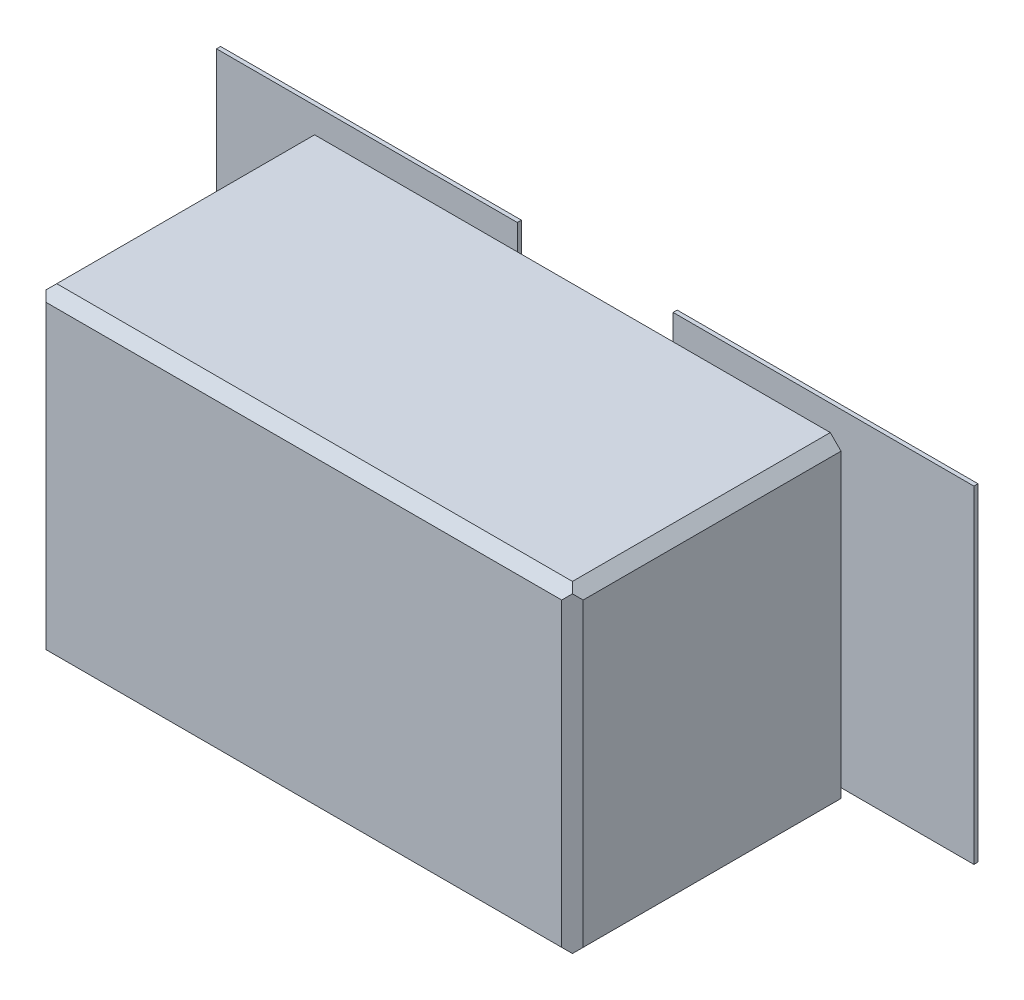
ISO-10303-21;
HEADER;
FILE_DESCRIPTION(('STEP AP214'),'2;1');
FILE_NAME('part.step','',(''),(''),'','','');
FILE_SCHEMA(('AUTOMOTIVE_DESIGN { 1 0 10303 214 1 1 1 1 }'));
ENDSEC;
DATA;
#1=APPLICATION_CONTEXT('core data for automotive mechanical design processes');
#2=APPLICATION_PROTOCOL_DEFINITION('international standard','automotive_design',2000,#1);
#3=PRODUCT_CONTEXT('',#1,'mechanical');
#4=PRODUCT('Part','Part','',(#3));
#5=PRODUCT_RELATED_PRODUCT_CATEGORY('part','',(#4));
#6=PRODUCT_DEFINITION_FORMATION('','',#4);
#7=PRODUCT_DEFINITION_CONTEXT('part definition',#1,'design');
#8=PRODUCT_DEFINITION('design','',#6,#7);
#9=PRODUCT_DEFINITION_SHAPE('','',#8);
#10=(LENGTH_UNIT() NAMED_UNIT(*) SI_UNIT(.MILLI.,.METRE.));
#11=(NAMED_UNIT(*) PLANE_ANGLE_UNIT() SI_UNIT($,.RADIAN.));
#12=(NAMED_UNIT(*) SI_UNIT($,.STERADIAN.) SOLID_ANGLE_UNIT());
#13=UNCERTAINTY_MEASURE_WITH_UNIT(LENGTH_MEASURE(1.E-05),#10,'distance_accuracy_value','');
#14=(GEOMETRIC_REPRESENTATION_CONTEXT(3) GLOBAL_UNCERTAINTY_ASSIGNED_CONTEXT((#13)) GLOBAL_UNIT_ASSIGNED_CONTEXT((#10,
#11,#12)) REPRESENTATION_CONTEXT('',''));
#15=CARTESIAN_POINT('',(0.,0.,0.));
#16=DIRECTION('',(0.,0.,1.));
#17=DIRECTION('',(1.,0.,0.));
#18=AXIS2_PLACEMENT_3D('',#15,#16,#17);
#19=CARTESIAN_POINT('',(-0.49,0.,0.6162));
#20=DIRECTION('',(-0.707106781186548,0.,0.707106781186548));
#21=DIRECTION('',(0.,1.,0.));
#22=AXIS2_PLACEMENT_3D('',#19,#20,#21);
#23=PLANE('',#22);
#24=DIRECTION('',(0.,-1.,0.));
#25=VECTOR('',#24,1.);
#26=CARTESIAN_POINT('',(-0.5,0.28,0.6062));
#27=LINE('',#26,#25);
#28=CARTESIAN_POINT('',(-0.5,0.28,0.6062));
#29=VERTEX_POINT('',#28);
#30=CARTESIAN_POINT('',(-0.5,-0.28,0.6062));
#31=VERTEX_POINT('',#30);
#32=EDGE_CURVE('P0_E283',#29,#31,#27,.T.);
#33=ORIENTED_EDGE('',*,*,#32,.T.);
#34=DIRECTION('',(-0.577350269189626,0.577350269189626,-0.577350269189626));
#35=VECTOR('',#34,1.);
#36=CARTESIAN_POINT('',(-0.49,-0.29,0.6162));
#37=LINE('',#36,#35);
#38=CARTESIAN_POINT('',(-0.49,-0.29,0.6162));
#39=VERTEX_POINT('',#38);
#40=EDGE_CURVE('P0_E423',#39,#31,#37,.T.);
#41=ORIENTED_EDGE('',*,*,#40,.F.);
#42=DIRECTION('',(-0.577350269189626,-0.577350269189626,-0.577350269189626));
#43=VECTOR('',#42,1.);
#44=CARTESIAN_POINT('',(-0.48,-0.28,0.6262));
#45=LINE('',#44,#43);
#46=CARTESIAN_POINT('',(-0.48,-0.28,0.6262));
#47=VERTEX_POINT('',#46);
#48=EDGE_CURVE('P0_E11',#47,#39,#45,.T.);
#49=ORIENTED_EDGE('',*,*,#48,.F.);
#50=DIRECTION('',(0.,-1.,0.));
#51=VECTOR('',#50,1.);
#52=CARTESIAN_POINT('',(-0.48,0.28,0.6262));
#53=LINE('',#52,#51);
#54=CARTESIAN_POINT('',(-0.48,0.28,0.6262));
#55=VERTEX_POINT('',#54);
#56=EDGE_CURVE('P0_E163',#55,#47,#53,.T.);
#57=ORIENTED_EDGE('',*,*,#56,.F.);
#58=DIRECTION('',(0.577350269189626,-0.577350269189626,0.577350269189626));
#59=VECTOR('',#58,1.);
#60=CARTESIAN_POINT('',(-0.49,0.29,0.6162));
#61=LINE('',#60,#59);
#62=CARTESIAN_POINT('',(-0.49,0.29,0.6162));
#63=VERTEX_POINT('',#62);
#64=EDGE_CURVE('P0_E103',#63,#55,#61,.T.);
#65=ORIENTED_EDGE('',*,*,#64,.F.);
#66=DIRECTION('',(0.577350269189626,0.577350269189626,0.577350269189626));
#67=VECTOR('',#66,1.);
#68=CARTESIAN_POINT('',(-0.5,0.28,0.6062));
#69=LINE('',#68,#67);
#70=EDGE_CURVE('P0_E117',#29,#63,#69,.T.);
#71=ORIENTED_EDGE('',*,*,#70,.F.);
#72=EDGE_LOOP('',(#33,#41,#49,#57,#65,#71));
#73=FACE_BOUND('',#72,.T.);
#74=ADVANCED_FACE('P0_F16',(#73),#23,.T.);
#75=CARTESIAN_POINT('',(0.,-0.29,0.6162));
#76=DIRECTION('',(0.,-0.707106781186548,0.707106781186548));
#77=DIRECTION('',(-1.,0.,0.));
#78=AXIS2_PLACEMENT_3D('',#75,#76,#77);
#79=PLANE('',#78);
#80=DIRECTION('',(1.,0.,0.));
#81=VECTOR('',#80,1.);
#82=CARTESIAN_POINT('',(-0.48,-0.3,0.6062));
#83=LINE('',#82,#81);
#84=CARTESIAN_POINT('',(-0.48,-0.3,0.6062));
#85=VERTEX_POINT('',#84);
#86=CARTESIAN_POINT('',(0.48,-0.3,0.6062));
#87=VERTEX_POINT('',#86);
#88=EDGE_CURVE('P0_E291',#85,#87,#83,.T.);
#89=ORIENTED_EDGE('',*,*,#88,.T.);
#90=DIRECTION('',(-0.577350269189626,-0.577350269189626,-0.577350269189626));
#91=VECTOR('',#90,1.);
#92=CARTESIAN_POINT('',(0.49,-0.29,0.6162));
#93=LINE('',#92,#91);
#94=CARTESIAN_POINT('',(0.49,-0.29,0.6162));
#95=VERTEX_POINT('',#94);
#96=EDGE_CURVE('P0_E292',#95,#87,#93,.T.);
#97=ORIENTED_EDGE('',*,*,#96,.F.);
#98=DIRECTION('',(0.577350269189626,-0.577350269189626,-0.577350269189626));
#99=VECTOR('',#98,1.);
#100=CARTESIAN_POINT('',(0.48,-0.28,0.6262));
#101=LINE('',#100,#99);
#102=CARTESIAN_POINT('',(0.48,-0.28,0.6262));
#103=VERTEX_POINT('',#102);
#104=EDGE_CURVE('P0_E26',#103,#95,#101,.T.);
#105=ORIENTED_EDGE('',*,*,#104,.F.);
#106=DIRECTION('',(1.,0.,0.));
#107=VECTOR('',#106,1.);
#108=CARTESIAN_POINT('',(-0.48,-0.28,0.6262));
#109=LINE('',#108,#107);
#110=EDGE_CURVE('P0_E264',#47,#103,#109,.T.);
#111=ORIENTED_EDGE('',*,*,#110,.F.);
#112=ORIENTED_EDGE('',*,*,#48,.T.);
#113=DIRECTION('',(-0.577350269189626,0.577350269189626,0.577350269189626));
#114=VECTOR('',#113,1.);
#115=CARTESIAN_POINT('',(-0.48,-0.3,0.6062));
#116=LINE('',#115,#114);
#117=EDGE_CURVE('P0_E262',#85,#39,#116,.T.);
#118=ORIENTED_EDGE('',*,*,#117,.F.);
#119=EDGE_LOOP('',(#89,#97,#105,#111,#112,#118));
#120=FACE_BOUND('',#119,.T.);
#121=ADVANCED_FACE('P0_F18',(#120),#79,.T.);
#122=CARTESIAN_POINT('',(0.49,0.,0.6162));
#123=DIRECTION('',(0.707106781186548,0.,0.707106781186548));
#124=DIRECTION('',(0.,-1.,0.));
#125=AXIS2_PLACEMENT_3D('',#122,#123,#124);
#126=PLANE('',#125);
#127=DIRECTION('',(0.,1.,0.));
#128=VECTOR('',#127,1.);
#129=CARTESIAN_POINT('',(0.5,-0.28,0.6062));
#130=LINE('',#129,#128);
#131=CARTESIAN_POINT('',(0.5,-0.28,0.6062));
#132=VERTEX_POINT('',#131);
#133=CARTESIAN_POINT('',(0.5,0.28,0.6062));
#134=VERTEX_POINT('',#133);
#135=EDGE_CURVE('P0_E328',#132,#134,#130,.T.);
#136=ORIENTED_EDGE('',*,*,#135,.T.);
#137=DIRECTION('',(0.577350269189626,-0.577350269189626,-0.577350269189626));
#138=VECTOR('',#137,1.);
#139=CARTESIAN_POINT('',(0.49,0.29,0.6162));
#140=LINE('',#139,#138);
#141=CARTESIAN_POINT('',(0.49,0.29,0.6162));
#142=VERTEX_POINT('',#141);
#143=EDGE_CURVE('P0_E318',#142,#134,#140,.T.);
#144=ORIENTED_EDGE('',*,*,#143,.F.);
#145=DIRECTION('',(0.577350269189626,0.577350269189626,-0.577350269189626));
#146=VECTOR('',#145,1.);
#147=CARTESIAN_POINT('',(0.48,0.28,0.6262));
#148=LINE('',#147,#146);
#149=CARTESIAN_POINT('',(0.48,0.28,0.6262));
#150=VERTEX_POINT('',#149);
#151=EDGE_CURVE('P0_E359',#150,#142,#148,.T.);
#152=ORIENTED_EDGE('',*,*,#151,.F.);
#153=DIRECTION('',(0.,1.,0.));
#154=VECTOR('',#153,1.);
#155=CARTESIAN_POINT('',(0.48,-0.28,0.6262));
#156=LINE('',#155,#154);
#157=EDGE_CURVE('P0_E173',#103,#150,#156,.T.);
#158=ORIENTED_EDGE('',*,*,#157,.F.);
#159=ORIENTED_EDGE('',*,*,#104,.T.);
#160=DIRECTION('',(-0.577350269189626,-0.577350269189626,0.577350269189626));
#161=VECTOR('',#160,1.);
#162=CARTESIAN_POINT('',(0.5,-0.28,0.6062));
#163=LINE('',#162,#161);
#164=EDGE_CURVE('P0_E327',#132,#95,#163,.T.);
#165=ORIENTED_EDGE('',*,*,#164,.F.);
#166=EDGE_LOOP('',(#136,#144,#152,#158,#159,#165));
#167=FACE_BOUND('',#166,.T.);
#168=ADVANCED_FACE('P0_F480',(#167),#126,.T.);
#169=CARTESIAN_POINT('',(0.,0.,0.6262));
#170=DIRECTION('',(0.,0.,1.));
#171=DIRECTION('',(1.,0.,0.));
#172=AXIS2_PLACEMENT_3D('',#169,#170,#171);
#173=PLANE('',#172);
#174=ORIENTED_EDGE('',*,*,#157,.T.);
#175=DIRECTION('',(-1.,0.,0.));
#176=VECTOR('',#175,1.);
#177=CARTESIAN_POINT('',(0.48,0.28,0.6262));
#178=LINE('',#177,#176);
#179=EDGE_CURVE('P0_E334',#150,#55,#178,.T.);
#180=ORIENTED_EDGE('',*,*,#179,.T.);
#181=ORIENTED_EDGE('',*,*,#56,.T.);
#182=ORIENTED_EDGE('',*,*,#110,.T.);
#183=EDGE_LOOP('',(#174,#180,#181,#182));
#184=FACE_BOUND('',#183,.T.);
#185=ADVANCED_FACE('P0_F472',(#184),#173,.T.);
#186=CARTESIAN_POINT('',(0.,0.29,0.6162));
#187=DIRECTION('',(0.,0.707106781186548,0.707106781186548));
#188=DIRECTION('',(1.,0.,0.));
#189=AXIS2_PLACEMENT_3D('',#186,#187,#188);
#190=PLANE('',#189);
#191=ORIENTED_EDGE('',*,*,#179,.F.);
#192=ORIENTED_EDGE('',*,*,#151,.T.);
#193=DIRECTION('',(0.577350269189626,-0.577350269189626,0.577350269189626));
#194=VECTOR('',#193,1.);
#195=CARTESIAN_POINT('',(0.48,0.3,0.6062));
#196=LINE('',#195,#194);
#197=CARTESIAN_POINT('',(0.48,0.3,0.6062));
#198=VERTEX_POINT('',#197);
#199=EDGE_CURVE('P0_E314',#198,#142,#196,.T.);
#200=ORIENTED_EDGE('',*,*,#199,.F.);
#201=DIRECTION('',(-1.,0.,0.));
#202=VECTOR('',#201,1.);
#203=CARTESIAN_POINT('',(0.48,0.3,0.6062));
#204=LINE('',#203,#202);
#205=CARTESIAN_POINT('',(-0.48,0.3,0.6062));
#206=VERTEX_POINT('',#205);
#207=EDGE_CURVE('P0_E310',#198,#206,#204,.T.);
#208=ORIENTED_EDGE('',*,*,#207,.T.);
#209=DIRECTION('',(-0.577350269189626,-0.577350269189626,0.577350269189626));
#210=VECTOR('',#209,1.);
#211=CARTESIAN_POINT('',(-0.48,0.3,0.6062));
#212=LINE('',#211,#210);
#213=EDGE_CURVE('P0_E311',#206,#63,#212,.T.);
#214=ORIENTED_EDGE('',*,*,#213,.T.);
#215=ORIENTED_EDGE('',*,*,#64,.T.);
#216=EDGE_LOOP('',(#191,#192,#200,#208,#214,#215));
#217=FACE_BOUND('',#216,.T.);
#218=ADVANCED_FACE('P0_F463',(#217),#190,.T.);
#219=CARTESIAN_POINT('',(0.5,0.3,0.0762));
#220=DIRECTION('',(0.,1.,0.));
#221=DIRECTION('',(1.,0.,0.));
#222=AXIS2_PLACEMENT_3D('',#219,#220,#221);
#223=PLANE('',#222);
#224=DIRECTION('',(0.,0.,-1.));
#225=VECTOR('',#224,1.);
#226=CARTESIAN_POINT('',(0.48,0.3,0.6062));
#227=LINE('',#226,#225);
#228=CARTESIAN_POINT('',(0.48,0.3,0.1262));
#229=VERTEX_POINT('',#228);
#230=EDGE_CURVE('P0_E56',#198,#229,#227,.T.);
#231=ORIENTED_EDGE('',*,*,#230,.T.);
#232=DIRECTION('',(-1.,0.,0.));
#233=VECTOR('',#232,1.);
#234=CARTESIAN_POINT('',(0.48,0.3,0.1262));
#235=LINE('',#234,#233);
#236=CARTESIAN_POINT('',(-0.48,0.3,0.1262));
#237=VERTEX_POINT('',#236);
#238=EDGE_CURVE('P0_E278',#229,#237,#235,.T.);
#239=ORIENTED_EDGE('',*,*,#238,.T.);
#240=DIRECTION('',(0.,0.,-1.));
#241=VECTOR('',#240,1.);
#242=CARTESIAN_POINT('',(-0.48,0.3,0.6062));
#243=LINE('',#242,#241);
#244=EDGE_CURVE('P0_E307',#206,#237,#243,.T.);
#245=ORIENTED_EDGE('',*,*,#244,.F.);
#246=ORIENTED_EDGE('',*,*,#207,.F.);
#247=EDGE_LOOP('',(#231,#239,#245,#246));
#248=FACE_BOUND('',#247,.T.);
#249=ADVANCED_FACE('P0_F461',(#248),#223,.T.);
#250=CARTESIAN_POINT('',(-0.49,0.29,0.3762));
#251=DIRECTION('',(-0.707106781186548,0.707106781186548,0.));
#252=DIRECTION('',(0.,0.,1.));
#253=AXIS2_PLACEMENT_3D('',#250,#251,#252);
#254=PLANE('',#253);
#255=DIRECTION('',(0.707106781186548,0.707106781186548,0.));
#256=VECTOR('',#255,1.);
#257=CARTESIAN_POINT('',(-0.5,0.28,0.1262));
#258=LINE('',#257,#256);
#259=CARTESIAN_POINT('',(-0.5,0.28,0.1262));
#260=VERTEX_POINT('',#259);
#261=EDGE_CURVE('P0_E282',#260,#237,#258,.T.);
#262=ORIENTED_EDGE('',*,*,#261,.F.);
#263=DIRECTION('',(0.,0.,-1.));
#264=VECTOR('',#263,1.);
#265=CARTESIAN_POINT('',(-0.5,0.28,0.6062));
#266=LINE('',#265,#264);
#267=EDGE_CURVE('P0_E286',#29,#260,#266,.T.);
#268=ORIENTED_EDGE('',*,*,#267,.F.);
#269=ORIENTED_EDGE('',*,*,#70,.T.);
#270=ORIENTED_EDGE('',*,*,#213,.F.);
#271=ORIENTED_EDGE('',*,*,#244,.T.);
#272=EDGE_LOOP('',(#262,#268,#269,#270,#271));
#273=FACE_BOUND('',#272,.T.);
#274=ADVANCED_FACE('P0_F457',(#273),#254,.T.);
#275=CARTESIAN_POINT('',(-0.5,0.3,0.0762));
#276=DIRECTION('',(-1.,0.,0.));
#277=DIRECTION('',(0.,0.,1.));
#278=AXIS2_PLACEMENT_3D('',#275,#276,#277);
#279=PLANE('',#278);
#280=DIRECTION('',(0.,0.,-1.));
#281=VECTOR('',#280,1.);
#282=CARTESIAN_POINT('',(-0.5,-0.28,0.6062));
#283=LINE('',#282,#281);
#284=CARTESIAN_POINT('',(-0.5,-0.28,0.1262));
#285=VERTEX_POINT('',#284);
#286=EDGE_CURVE('P0_E287',#31,#285,#283,.T.);
#287=ORIENTED_EDGE('',*,*,#286,.F.);
#288=ORIENTED_EDGE('',*,*,#32,.F.);
#289=ORIENTED_EDGE('',*,*,#267,.T.);
#290=DIRECTION('',(0.,-1.,0.));
#291=VECTOR('',#290,1.);
#292=CARTESIAN_POINT('',(-0.5,0.28,0.1262));
#293=LINE('',#292,#291);
#294=EDGE_CURVE('P0_E388',#260,#285,#293,.T.);
#295=ORIENTED_EDGE('',*,*,#294,.T.);
#296=EDGE_LOOP('',(#287,#288,#289,#295));
#297=FACE_BOUND('',#296,.T.);
#298=ADVANCED_FACE('P0_F470',(#297),#279,.T.);
#299=CARTESIAN_POINT('',(-0.49,-0.29,0.3762));
#300=DIRECTION('',(-0.707106781186548,-0.707106781186548,0.));
#301=DIRECTION('',(-0.707106781186548,0.707106781186548,0.));
#302=AXIS2_PLACEMENT_3D('',#299,#300,#301);
#303=PLANE('',#302);
#304=DIRECTION('',(-0.707106781186548,0.707106781186548,0.));
#305=VECTOR('',#304,1.);
#306=CARTESIAN_POINT('',(-0.48,-0.3,0.1262));
#307=LINE('',#306,#305);
#308=CARTESIAN_POINT('',(-0.48,-0.3,0.1262));
#309=VERTEX_POINT('',#308);
#310=EDGE_CURVE('P0_E385',#309,#285,#307,.T.);
#311=ORIENTED_EDGE('',*,*,#310,.F.);
#312=DIRECTION('',(0.,0.,-1.));
#313=VECTOR('',#312,1.);
#314=CARTESIAN_POINT('',(-0.48,-0.3,0.6062));
#315=LINE('',#314,#313);
#316=EDGE_CURVE('P0_E407',#85,#309,#315,.T.);
#317=ORIENTED_EDGE('',*,*,#316,.F.);
#318=ORIENTED_EDGE('',*,*,#117,.T.);
#319=ORIENTED_EDGE('',*,*,#40,.T.);
#320=ORIENTED_EDGE('',*,*,#286,.T.);
#321=EDGE_LOOP('',(#311,#317,#318,#319,#320));
#322=FACE_BOUND('',#321,.T.);
#323=ADVANCED_FACE('P0_F519',(#322),#303,.T.);
#324=CARTESIAN_POINT('',(-0.5,-0.3,0.0762));
#325=DIRECTION('',(0.,-1.,0.));
#326=DIRECTION('',(0.,0.,-1.));
#327=AXIS2_PLACEMENT_3D('',#324,#325,#326);
#328=PLANE('',#327);
#329=DIRECTION('',(0.,0.,-1.));
#330=VECTOR('',#329,1.);
#331=CARTESIAN_POINT('',(0.48,-0.3,0.6062));
#332=LINE('',#331,#330);
#333=CARTESIAN_POINT('',(0.48,-0.3,0.1262));
#334=VERTEX_POINT('',#333);
#335=EDGE_CURVE('P0_E288',#87,#334,#332,.T.);
#336=ORIENTED_EDGE('',*,*,#335,.F.);
#337=ORIENTED_EDGE('',*,*,#88,.F.);
#338=ORIENTED_EDGE('',*,*,#316,.T.);
#339=DIRECTION('',(1.,0.,0.));
#340=VECTOR('',#339,1.);
#341=CARTESIAN_POINT('',(-0.48,-0.3,0.1262));
#342=LINE('',#341,#340);
#343=EDGE_CURVE('P0_E301',#309,#334,#342,.T.);
#344=ORIENTED_EDGE('',*,*,#343,.T.);
#345=EDGE_LOOP('',(#336,#337,#338,#344));
#346=FACE_BOUND('',#345,.T.);
#347=ADVANCED_FACE('P0_F515',(#346),#328,.T.);
#348=CARTESIAN_POINT('',(0.49,-0.29,0.3762));
#349=DIRECTION('',(0.707106781186548,-0.707106781186548,0.));
#350=DIRECTION('',(0.,0.,-1.));
#351=AXIS2_PLACEMENT_3D('',#348,#349,#350);
#352=PLANE('',#351);
#353=DIRECTION('',(-0.707106781186548,-0.707106781186548,0.));
#354=VECTOR('',#353,1.);
#355=CARTESIAN_POINT('',(0.5,-0.28,0.1262));
#356=LINE('',#355,#354);
#357=CARTESIAN_POINT('',(0.5,-0.28,0.1262));
#358=VERTEX_POINT('',#357);
#359=EDGE_CURVE('P0_E297',#358,#334,#356,.T.);
#360=ORIENTED_EDGE('',*,*,#359,.F.);
#361=DIRECTION('',(0.,0.,-1.));
#362=VECTOR('',#361,1.);
#363=CARTESIAN_POINT('',(0.5,-0.28,0.6062));
#364=LINE('',#363,#362);
#365=EDGE_CURVE('P0_E324',#132,#358,#364,.T.);
#366=ORIENTED_EDGE('',*,*,#365,.F.);
#367=ORIENTED_EDGE('',*,*,#164,.T.);
#368=ORIENTED_EDGE('',*,*,#96,.T.);
#369=ORIENTED_EDGE('',*,*,#335,.T.);
#370=EDGE_LOOP('',(#360,#366,#367,#368,#369));
#371=FACE_BOUND('',#370,.T.);
#372=ADVANCED_FACE('P0_F518',(#371),#352,.T.);
#373=CARTESIAN_POINT('',(0.5,-0.3,0.0762));
#374=DIRECTION('',(1.,0.,0.));
#375=DIRECTION('',(0.,1.,0.));
#376=AXIS2_PLACEMENT_3D('',#373,#374,#375);
#377=PLANE('',#376);
#378=DIRECTION('',(0.,0.,-1.));
#379=VECTOR('',#378,1.);
#380=CARTESIAN_POINT('',(0.5,0.28,0.6062));
#381=LINE('',#380,#379);
#382=CARTESIAN_POINT('',(0.5,0.28,0.1262));
#383=VERTEX_POINT('',#382);
#384=EDGE_CURVE('P0_E353',#134,#383,#381,.T.);
#385=ORIENTED_EDGE('',*,*,#384,.F.);
#386=ORIENTED_EDGE('',*,*,#135,.F.);
#387=ORIENTED_EDGE('',*,*,#365,.T.);
#388=DIRECTION('',(0.,1.,0.));
#389=VECTOR('',#388,1.);
#390=CARTESIAN_POINT('',(0.5,-0.28,0.1262));
#391=LINE('',#390,#389);
#392=EDGE_CURVE('P0_E302',#358,#383,#391,.T.);
#393=ORIENTED_EDGE('',*,*,#392,.T.);
#394=EDGE_LOOP('',(#385,#386,#387,#393));
#395=FACE_BOUND('',#394,.T.);
#396=ADVANCED_FACE('P0_F502',(#395),#377,.T.);
#397=CARTESIAN_POINT('',(0.49,0.29,0.3762));
#398=DIRECTION('',(0.707106781186548,0.707106781186548,0.));
#399=DIRECTION('',(0.,0.,-1.));
#400=AXIS2_PLACEMENT_3D('',#397,#398,#399);
#401=PLANE('',#400);
#402=DIRECTION('',(0.707106781186498,-0.707106781186598,0.));
#403=VECTOR('',#402,1.);
#404=CARTESIAN_POINT('',(0.48,0.3,0.1262));
#405=LINE('',#404,#403);
#406=EDGE_CURVE('P0_E414',#229,#383,#405,.T.);
#407=ORIENTED_EDGE('',*,*,#406,.F.);
#408=ORIENTED_EDGE('',*,*,#230,.F.);
#409=ORIENTED_EDGE('',*,*,#199,.T.);
#410=ORIENTED_EDGE('',*,*,#143,.T.);
#411=ORIENTED_EDGE('',*,*,#384,.T.);
#412=EDGE_LOOP('',(#407,#408,#409,#410,#411));
#413=FACE_BOUND('',#412,.T.);
#414=ADVANCED_FACE('P0_F499',(#413),#401,.T.);
#415=CARTESIAN_POINT('',(-0.4659973957868,-0.25,0.1262));
#416=DIRECTION('',(-1.,0.,0.));
#417=DIRECTION('',(0.,0.,1.));
#418=AXIS2_PLACEMENT_3D('',#415,#416,#417);
#419=PLANE('',#418);
#420=DIRECTION('',(0.,1.,0.));
#421=VECTOR('',#420,1.);
#422=CARTESIAN_POINT('',(-0.4659973957868,-0.25,0.1262));
#423=LINE('',#422,#421);
#424=CARTESIAN_POINT('',(-0.4659973957868,-0.25,0.1262));
#425=VERTEX_POINT('',#424);
#426=CARTESIAN_POINT('',(-0.4659973957868,0.2,0.1262));
#427=VERTEX_POINT('',#426);
#428=EDGE_CURVE('P0_E228',#425,#427,#423,.T.);
#429=ORIENTED_EDGE('',*,*,#428,.T.);
#430=DIRECTION('',(0.,0.,-1.));
#431=VECTOR('',#430,1.);
#432=CARTESIAN_POINT('',(-0.4659973957868,0.2,0.1262));
#433=LINE('',#432,#431);
#434=CARTESIAN_POINT('',(-0.4659973957868,0.2,0.0862));
#435=VERTEX_POINT('',#434);
#436=EDGE_CURVE('P0_E266',#427,#435,#433,.T.);
#437=ORIENTED_EDGE('',*,*,#436,.T.);
#438=DIRECTION('',(0.,1.,0.));
#439=VECTOR('',#438,1.);
#440=CARTESIAN_POINT('',(-0.4659973957868,-0.25,0.0862));
#441=LINE('',#440,#439);
#442=CARTESIAN_POINT('',(-0.4659973957868,-0.25,0.0862));
#443=VERTEX_POINT('',#442);
#444=EDGE_CURVE('P0_E246',#443,#435,#441,.T.);
#445=ORIENTED_EDGE('',*,*,#444,.F.);
#446=DIRECTION('',(0.,0.,-1.));
#447=VECTOR('',#446,1.);
#448=CARTESIAN_POINT('',(-0.4659973957868,-0.25,0.1262));
#449=LINE('',#448,#447);
#450=EDGE_CURVE('P0_E243',#425,#443,#449,.T.);
#451=ORIENTED_EDGE('',*,*,#450,.F.);
#452=EDGE_LOOP('',(#429,#437,#445,#451));
#453=FACE_BOUND('',#452,.T.);
#454=ADVANCED_FACE('P0_F244',(#453),#419,.T.);
#455=CARTESIAN_POINT('',(-0.4659973957868,0.25,0.1262));
#456=DIRECTION('',(0.,0.,-1.));
#457=DIRECTION('',(-1.,0.,0.));
#458=AXIS2_PLACEMENT_3D('',#455,#456,#457);
#459=CYLINDRICAL_SURFACE('',#458,0.05);
#460=CARTESIAN_POINT('',(-0.4659973957868,0.25,0.1262));
#461=DIRECTION('',(0.,0.,-1.));
#462=DIRECTION('',(1.,0.,0.));
#463=AXIS2_PLACEMENT_3D('',#460,#461,#462);
#464=CIRCLE('',#463,0.05);
#465=CARTESIAN_POINT('',(-0.4159973957868,0.25,0.1262));
#466=VERTEX_POINT('',#465);
#467=EDGE_CURVE('P0_E237',#466,#427,#464,.T.);
#468=ORIENTED_EDGE('',*,*,#467,.F.);
#469=DIRECTION('',(0.,0.,-1.));
#470=VECTOR('',#469,1.);
#471=CARTESIAN_POINT('',(-0.4159973957868,0.25,0.1262));
#472=LINE('',#471,#470);
#473=CARTESIAN_POINT('',(-0.4159973957868,0.25,0.0862));
#474=VERTEX_POINT('',#473);
#475=EDGE_CURVE('P0_E269',#466,#474,#472,.T.);
#476=ORIENTED_EDGE('',*,*,#475,.T.);
#477=CARTESIAN_POINT('',(-0.4659973957868,0.25,0.0862));
#478=DIRECTION('',(0.,0.,1.));
#479=DIRECTION('',(0.,-1.,0.));
#480=AXIS2_PLACEMENT_3D('',#477,#478,#479);
#481=CIRCLE('',#480,0.05);
#482=EDGE_CURVE('P0_E357',#435,#474,#481,.T.);
#483=ORIENTED_EDGE('',*,*,#482,.F.);
#484=ORIENTED_EDGE('',*,*,#436,.F.);
#485=EDGE_LOOP('',(#468,#476,#483,#484));
#486=FACE_BOUND('',#485,.T.);
#487=ADVANCED_FACE('P0_F494',(#486),#459,.F.);
#488=CARTESIAN_POINT('',(-0.4159973957868,0.25,0.1262));
#489=DIRECTION('',(0.,1.,0.));
#490=DIRECTION('',(1.,0.,0.));
#491=AXIS2_PLACEMENT_3D('',#488,#489,#490);
#492=PLANE('',#491);
#493=DIRECTION('',(1.,0.,0.));
#494=VECTOR('',#493,1.);
#495=CARTESIAN_POINT('',(-0.4159973957868,0.25,0.1262));
#496=LINE('',#495,#494);
#497=CARTESIAN_POINT('',(-0.2159973957868,0.25,0.1262));
#498=VERTEX_POINT('',#497);
#499=EDGE_CURVE('P0_E323',#466,#498,#496,.T.);
#500=ORIENTED_EDGE('',*,*,#499,.T.);
#501=DIRECTION('',(0.,0.,-1.));
#502=VECTOR('',#501,1.);
#503=CARTESIAN_POINT('',(-0.2159973957868,0.25,0.1262));
#504=LINE('',#503,#502);
#505=CARTESIAN_POINT('',(-0.2159973957868,0.25,0.0862));
#506=VERTEX_POINT('',#505);
#507=EDGE_CURVE('P0_E293',#498,#506,#504,.T.);
#508=ORIENTED_EDGE('',*,*,#507,.T.);
#509=DIRECTION('',(1.,0.,0.));
#510=VECTOR('',#509,1.);
#511=CARTESIAN_POINT('',(-0.4159973957868,0.25,0.0862));
#512=LINE('',#511,#510);
#513=EDGE_CURVE('P0_E296',#474,#506,#512,.T.);
#514=ORIENTED_EDGE('',*,*,#513,.F.);
#515=ORIENTED_EDGE('',*,*,#475,.F.);
#516=EDGE_LOOP('',(#500,#508,#514,#515));
#517=FACE_BOUND('',#516,.T.);
#518=ADVANCED_FACE('P0_F487',(#517),#492,.T.);
#519=CARTESIAN_POINT('',(-0.2159973957868,0.25,0.1262));
#520=DIRECTION('',(1.,0.,0.));
#521=DIRECTION('',(0.,1.,0.));
#522=AXIS2_PLACEMENT_3D('',#519,#520,#521);
#523=PLANE('',#522);
#524=DIRECTION('',(0.,-1.,0.));
#525=VECTOR('',#524,1.);
#526=CARTESIAN_POINT('',(-0.2159973957868,0.25,0.1262));
#527=LINE('',#526,#525);
#528=CARTESIAN_POINT('',(-0.2159973957868,-0.25,0.1262));
#529=VERTEX_POINT('',#528);
#530=EDGE_CURVE('P0_E281',#498,#529,#527,.T.);
#531=ORIENTED_EDGE('',*,*,#530,.T.);
#532=DIRECTION('',(0.,0.,-1.));
#533=VECTOR('',#532,1.);
#534=CARTESIAN_POINT('',(-0.2159973957868,-0.25,0.1262));
#535=LINE('',#534,#533);
#536=CARTESIAN_POINT('',(-0.2159973957868,-0.25,0.0862));
#537=VERTEX_POINT('',#536);
#538=EDGE_CURVE('P0_E254',#529,#537,#535,.T.);
#539=ORIENTED_EDGE('',*,*,#538,.T.);
#540=DIRECTION('',(0.,-1.,0.));
#541=VECTOR('',#540,1.);
#542=CARTESIAN_POINT('',(-0.2159973957868,0.25,0.0862));
#543=LINE('',#542,#541);
#544=EDGE_CURVE('P0_E73',#506,#537,#543,.T.);
#545=ORIENTED_EDGE('',*,*,#544,.F.);
#546=ORIENTED_EDGE('',*,*,#507,.F.);
#547=EDGE_LOOP('',(#531,#539,#545,#546));
#548=FACE_BOUND('',#547,.T.);
#549=ADVANCED_FACE('P0_F483',(#548),#523,.T.);
#550=CARTESIAN_POINT('',(0.,0.,0.0862));
#551=DIRECTION('',(0.,0.,-1.));
#552=DIRECTION('',(0.,-1.,0.));
#553=AXIS2_PLACEMENT_3D('',#550,#551,#552);
#554=PLANE('',#553);
#555=ORIENTED_EDGE('',*,*,#544,.T.);
#556=DIRECTION('',(-1.,0.,0.));
#557=VECTOR('',#556,1.);
#558=CARTESIAN_POINT('',(-0.2159973957868,-0.25,0.0862));
#559=LINE('',#558,#557);
#560=EDGE_CURVE('P0_E250',#537,#443,#559,.T.);
#561=ORIENTED_EDGE('',*,*,#560,.T.);
#562=ORIENTED_EDGE('',*,*,#444,.T.);
#563=ORIENTED_EDGE('',*,*,#482,.T.);
#564=ORIENTED_EDGE('',*,*,#513,.T.);
#565=EDGE_LOOP('',(#555,#561,#562,#563,#564));
#566=FACE_BOUND('',#565,.T.);
#567=ADVANCED_FACE('P0_F486',(#566),#554,.T.);
#568=CARTESIAN_POINT('',(0.,0.,0.0862));
#569=DIRECTION('',(0.,0.,-1.));
#570=DIRECTION('',(0.,-1.,0.));
#571=AXIS2_PLACEMENT_3D('',#568,#569,#570);
#572=PLANE('',#571);
#573=DIRECTION('',(0.,-1.,0.));
#574=VECTOR('',#573,1.);
#575=CARTESIAN_POINT('',(0.4340026042132,0.25,0.0862));
#576=LINE('',#575,#574);
#577=CARTESIAN_POINT('',(0.4340026042132,0.25,0.0862));
#578=VERTEX_POINT('',#577);
#579=CARTESIAN_POINT('',(0.4340026042132,-0.25,0.0862));
#580=VERTEX_POINT('',#579);
#581=EDGE_CURVE('P0_E341',#578,#580,#576,.T.);
#582=ORIENTED_EDGE('',*,*,#581,.T.);
#583=DIRECTION('',(-1.,0.,0.));
#584=VECTOR('',#583,1.);
#585=CARTESIAN_POINT('',(0.4340026042132,-0.25,0.0862));
#586=LINE('',#585,#584);
#587=CARTESIAN_POINT('',(0.1840026042132,-0.25,0.0862));
#588=VERTEX_POINT('',#587);
#589=EDGE_CURVE('P0_E396',#580,#588,#586,.T.);
#590=ORIENTED_EDGE('',*,*,#589,.T.);
#591=DIRECTION('',(0.,1.,0.));
#592=VECTOR('',#591,1.);
#593=CARTESIAN_POINT('',(0.1840026042132,-0.25,0.0862));
#594=LINE('',#593,#592);
#595=CARTESIAN_POINT('',(0.1840026042132,0.25,0.0862));
#596=VERTEX_POINT('',#595);
#597=EDGE_CURVE('P0_E339',#588,#596,#594,.T.);
#598=ORIENTED_EDGE('',*,*,#597,.T.);
#599=DIRECTION('',(1.,0.,0.));
#600=VECTOR('',#599,1.);
#601=CARTESIAN_POINT('',(0.1840026042132,0.25,0.0862));
#602=LINE('',#601,#600);
#603=EDGE_CURVE('P0_E340',#596,#578,#602,.T.);
#604=ORIENTED_EDGE('',*,*,#603,.T.);
#605=EDGE_LOOP('',(#582,#590,#598,#604));
#606=FACE_BOUND('',#605,.T.);
#607=ADVANCED_FACE('P0_F491',(#606),#572,.T.);
#608=CARTESIAN_POINT('',(0.4340026042132,-0.25,0.1262));
#609=DIRECTION('',(0.,-1.,0.));
#610=DIRECTION('',(0.,0.,-1.));
#611=AXIS2_PLACEMENT_3D('',#608,#609,#610);
#612=PLANE('',#611);
#613=DIRECTION('',(-1.,0.,0.));
#614=VECTOR('',#613,1.);
#615=CARTESIAN_POINT('',(0.4340026042132,-0.25,0.1262));
#616=LINE('',#615,#614);
#617=CARTESIAN_POINT('',(0.4340026042132,-0.25,0.1262));
#618=VERTEX_POINT('',#617);
#619=CARTESIAN_POINT('',(0.1840026042132,-0.25,0.1262));
#620=VERTEX_POINT('',#619);
#621=EDGE_CURVE('P0_E272',#618,#620,#616,.T.);
#622=ORIENTED_EDGE('',*,*,#621,.T.);
#623=DIRECTION('',(0.,0.,-1.));
#624=VECTOR('',#623,1.);
#625=CARTESIAN_POINT('',(0.1840026042132,-0.25,0.1262));
#626=LINE('',#625,#624);
#627=EDGE_CURVE('P0_E392',#620,#588,#626,.T.);
#628=ORIENTED_EDGE('',*,*,#627,.T.);
#629=ORIENTED_EDGE('',*,*,#589,.F.);
#630=DIRECTION('',(0.,0.,-1.));
#631=VECTOR('',#630,1.);
#632=CARTESIAN_POINT('',(0.4340026042132,-0.25,0.1262));
#633=LINE('',#632,#631);
#634=EDGE_CURVE('P0_E276',#618,#580,#633,.T.);
#635=ORIENTED_EDGE('',*,*,#634,.F.);
#636=EDGE_LOOP('',(#622,#628,#629,#635));
#637=FACE_BOUND('',#636,.T.);
#638=ADVANCED_FACE('P0_F523',(#637),#612,.T.);
#639=CARTESIAN_POINT('',(0.1840026042132,-0.25,0.1262));
#640=DIRECTION('',(-1.,0.,0.));
#641=DIRECTION('',(0.,0.,1.));
#642=AXIS2_PLACEMENT_3D('',#639,#640,#641);
#643=PLANE('',#642);
#644=DIRECTION('',(0.,1.,0.));
#645=VECTOR('',#644,1.);
#646=CARTESIAN_POINT('',(0.1840026042132,-0.25,0.1262));
#647=LINE('',#646,#645);
#648=CARTESIAN_POINT('',(0.1840026042132,0.25,0.1262));
#649=VERTEX_POINT('',#648);
#650=EDGE_CURVE('P0_E277',#620,#649,#647,.T.);
#651=ORIENTED_EDGE('',*,*,#650,.T.);
#652=DIRECTION('',(0.,0.,-1.));
#653=VECTOR('',#652,1.);
#654=CARTESIAN_POINT('',(0.1840026042132,0.25,0.1262));
#655=LINE('',#654,#653);
#656=EDGE_CURVE('P0_E335',#649,#596,#655,.T.);
#657=ORIENTED_EDGE('',*,*,#656,.T.);
#658=ORIENTED_EDGE('',*,*,#597,.F.);
#659=ORIENTED_EDGE('',*,*,#627,.F.);
#660=EDGE_LOOP('',(#651,#657,#658,#659));
#661=FACE_BOUND('',#660,.T.);
#662=ADVANCED_FACE('P0_F508',(#661),#643,.T.);
#663=CARTESIAN_POINT('',(0.1840026042132,0.25,0.1262));
#664=DIRECTION('',(0.,1.,0.));
#665=DIRECTION('',(1.,0.,0.));
#666=AXIS2_PLACEMENT_3D('',#663,#664,#665);
#667=PLANE('',#666);
#668=DIRECTION('',(1.,0.,0.));
#669=VECTOR('',#668,1.);
#670=CARTESIAN_POINT('',(0.1840026042132,0.25,0.1262));
#671=LINE('',#670,#669);
#672=CARTESIAN_POINT('',(0.4340026042132,0.25,0.1262));
#673=VERTEX_POINT('',#672);
#674=EDGE_CURVE('P0_E303',#649,#673,#671,.T.);
#675=ORIENTED_EDGE('',*,*,#674,.T.);
#676=DIRECTION('',(0.,0.,-1.));
#677=VECTOR('',#676,1.);
#678=CARTESIAN_POINT('',(0.4340026042132,0.25,0.1262));
#679=LINE('',#678,#677);
#680=EDGE_CURVE('P0_E345',#673,#578,#679,.T.);
#681=ORIENTED_EDGE('',*,*,#680,.T.);
#682=ORIENTED_EDGE('',*,*,#603,.F.);
#683=ORIENTED_EDGE('',*,*,#656,.F.);
#684=EDGE_LOOP('',(#675,#681,#682,#683));
#685=FACE_BOUND('',#684,.T.);
#686=ADVANCED_FACE('P0_F504',(#685),#667,.T.);
#687=CARTESIAN_POINT('',(0.4340026042132,0.25,0.1262));
#688=DIRECTION('',(1.,0.,0.));
#689=DIRECTION('',(0.,1.,0.));
#690=AXIS2_PLACEMENT_3D('',#687,#688,#689);
#691=PLANE('',#690);
#692=DIRECTION('',(0.,-1.,0.));
#693=VECTOR('',#692,1.);
#694=CARTESIAN_POINT('',(0.4340026042132,0.25,0.1262));
#695=LINE('',#694,#693);
#696=EDGE_CURVE('P0_E240',#673,#618,#695,.T.);
#697=ORIENTED_EDGE('',*,*,#696,.T.);
#698=ORIENTED_EDGE('',*,*,#634,.T.);
#699=ORIENTED_EDGE('',*,*,#581,.F.);
#700=ORIENTED_EDGE('',*,*,#680,.F.);
#701=EDGE_LOOP('',(#697,#698,#699,#700));
#702=FACE_BOUND('',#701,.T.);
#703=ADVANCED_FACE('P0_F507',(#702),#691,.T.);
#704=CARTESIAN_POINT('',(0.,0.,0.1262));
#705=DIRECTION('',(0.,0.,1.));
#706=DIRECTION('',(1.,0.,0.));
#707=AXIS2_PLACEMENT_3D('',#704,#705,#706);
#708=PLANE('',#707);
#709=ORIENTED_EDGE('',*,*,#696,.F.);
#710=ORIENTED_EDGE('',*,*,#674,.F.);
#711=ORIENTED_EDGE('',*,*,#650,.F.);
#712=ORIENTED_EDGE('',*,*,#621,.F.);
#713=EDGE_LOOP('',(#709,#710,#711,#712));
#714=FACE_BOUND('',#713,.T.);
#715=ORIENTED_EDGE('',*,*,#530,.F.);
#716=ORIENTED_EDGE('',*,*,#499,.F.);
#717=ORIENTED_EDGE('',*,*,#467,.T.);
#718=ORIENTED_EDGE('',*,*,#428,.F.);
#719=DIRECTION('',(-1.,0.,0.));
#720=VECTOR('',#719,1.);
#721=CARTESIAN_POINT('',(-0.2159973957868,-0.25,0.1262));
#722=LINE('',#721,#720);
#723=EDGE_CURVE('P0_E234',#529,#425,#722,.T.);
#724=ORIENTED_EDGE('',*,*,#723,.F.);
#725=EDGE_LOOP('',(#715,#716,#717,#718,#724));
#726=FACE_BOUND('',#725,.T.);
#727=ORIENTED_EDGE('',*,*,#406,.T.);
#728=ORIENTED_EDGE('',*,*,#392,.F.);
#729=ORIENTED_EDGE('',*,*,#359,.T.);
#730=ORIENTED_EDGE('',*,*,#343,.F.);
#731=ORIENTED_EDGE('',*,*,#310,.T.);
#732=ORIENTED_EDGE('',*,*,#294,.F.);
#733=ORIENTED_EDGE('',*,*,#261,.T.);
#734=ORIENTED_EDGE('',*,*,#238,.F.);
#735=EDGE_LOOP('',(#727,#728,#729,#730,#731,#732,#733,#734));
#736=FACE_BOUND('',#735,.T.);
#737=ADVANCED_FACE('P0_F231',(#714,#726,#736),#708,.F.);
#738=CARTESIAN_POINT('',(-0.2159973957868,-0.25,0.1262));
#739=DIRECTION('',(0.,-1.,0.));
#740=DIRECTION('',(0.,0.,-1.));
#741=AXIS2_PLACEMENT_3D('',#738,#739,#740);
#742=PLANE('',#741);
#743=ORIENTED_EDGE('',*,*,#723,.T.);
#744=ORIENTED_EDGE('',*,*,#450,.T.);
#745=ORIENTED_EDGE('',*,*,#560,.F.);
#746=ORIENTED_EDGE('',*,*,#538,.F.);
#747=EDGE_LOOP('',(#743,#744,#745,#746));
#748=FACE_BOUND('',#747,.T.);
#749=ADVANCED_FACE('P0_F253',(#748),#742,.T.);
#750=CLOSED_SHELL('',(#74,#121,#168,#185,#218,#249,#274,#298,#323,#347,#372,#396,#414,#454,#487,
#518,#549,#567,#607,#638,#662,#686,#703,#737,#749));
#751=MANIFOLD_SOLID_BREP('P0_B1',#750);
#752=CARTESIAN_POINT('',(0.,0.,0.08382));
#753=DIRECTION('',(0.,0.,1.));
#754=DIRECTION('',(1.,0.,0.));
#755=AXIS2_PLACEMENT_3D('',#752,#753,#754);
#756=PLANE('',#755);
#757=DIRECTION('',(1.,0.,0.));
#758=VECTOR('',#757,1.);
#759=CARTESIAN_POINT('',(-0.705,-0.305,0.08382));
#760=LINE('',#759,#758);
#761=CARTESIAN_POINT('',(-0.705,-0.305,0.08382));
#762=VERTEX_POINT('',#761);
#763=CARTESIAN_POINT('',(-0.145,-0.305,0.08382));
#764=VERTEX_POINT('',#763);
#765=EDGE_CURVE('P1_E102',#762,#764,#760,.T.);
#766=ORIENTED_EDGE('',*,*,#765,.T.);
#767=DIRECTION('',(0.,1.,0.));
#768=VECTOR('',#767,1.);
#769=CARTESIAN_POINT('',(-0.145,-0.305,0.08382));
#770=LINE('',#769,#768);
#771=CARTESIAN_POINT('',(-0.145,0.305,0.08382));
#772=VERTEX_POINT('',#771);
#773=EDGE_CURVE('P1_E11',#764,#772,#770,.T.);
#774=ORIENTED_EDGE('',*,*,#773,.T.);
#775=DIRECTION('',(-1.,0.,0.));
#776=VECTOR('',#775,1.);
#777=CARTESIAN_POINT('',(-0.145,0.305,0.08382));
#778=LINE('',#777,#776);
#779=CARTESIAN_POINT('',(-0.705,0.305,0.08382));
#780=VERTEX_POINT('',#779);
#781=EDGE_CURVE('P1_E20',#772,#780,#778,.T.);
#782=ORIENTED_EDGE('',*,*,#781,.T.);
#783=DIRECTION('',(0.,-1.,0.));
#784=VECTOR('',#783,1.);
#785=CARTESIAN_POINT('',(-0.705,0.305,0.08382));
#786=LINE('',#785,#784);
#787=EDGE_CURVE('P1_E74',#780,#762,#786,.T.);
#788=ORIENTED_EDGE('',*,*,#787,.T.);
#789=EDGE_LOOP('',(#766,#774,#782,#788));
#790=FACE_BOUND('',#789,.T.);
#791=ADVANCED_FACE('P1_F16',(#790),#756,.T.);
#792=CARTESIAN_POINT('',(-0.145,-0.305,0.0762));
#793=DIRECTION('',(1.,0.,0.));
#794=DIRECTION('',(0.,1.,0.));
#795=AXIS2_PLACEMENT_3D('',#792,#793,#794);
#796=PLANE('',#795);
#797=DIRECTION('',(0.,1.,0.));
#798=VECTOR('',#797,1.);
#799=CARTESIAN_POINT('',(-0.145,-0.305,0.0762));
#800=LINE('',#799,#798);
#801=CARTESIAN_POINT('',(-0.145,-0.305,0.0762));
#802=VERTEX_POINT('',#801);
#803=CARTESIAN_POINT('',(-0.145,0.305,0.0762));
#804=VERTEX_POINT('',#803);
#805=EDGE_CURVE('P1_E85',#802,#804,#800,.T.);
#806=ORIENTED_EDGE('',*,*,#805,.T.);
#807=DIRECTION('',(0.,0.,1.));
#808=VECTOR('',#807,1.);
#809=CARTESIAN_POINT('',(-0.145,0.305,0.0762));
#810=LINE('',#809,#808);
#811=EDGE_CURVE('P1_E27',#804,#772,#810,.T.);
#812=ORIENTED_EDGE('',*,*,#811,.T.);
#813=ORIENTED_EDGE('',*,*,#773,.F.);
#814=DIRECTION('',(0.,0.,1.));
#815=VECTOR('',#814,1.);
#816=CARTESIAN_POINT('',(-0.145,-0.305,0.0762));
#817=LINE('',#816,#815);
#818=EDGE_CURVE('P1_E104',#802,#764,#817,.T.);
#819=ORIENTED_EDGE('',*,*,#818,.F.);
#820=EDGE_LOOP('',(#806,#812,#813,#819));
#821=FACE_BOUND('',#820,.T.);
#822=ADVANCED_FACE('P1_F120',(#821),#796,.T.);
#823=CARTESIAN_POINT('',(-0.145,0.305,0.0762));
#824=DIRECTION('',(0.,1.,0.));
#825=DIRECTION('',(1.,0.,0.));
#826=AXIS2_PLACEMENT_3D('',#823,#824,#825);
#827=PLANE('',#826);
#828=DIRECTION('',(-1.,0.,0.));
#829=VECTOR('',#828,1.);
#830=CARTESIAN_POINT('',(-0.145,0.305,0.0762));
#831=LINE('',#830,#829);
#832=CARTESIAN_POINT('',(-0.705,0.305,0.0762));
#833=VERTEX_POINT('',#832);
#834=EDGE_CURVE('P1_E80',#804,#833,#831,.T.);
#835=ORIENTED_EDGE('',*,*,#834,.T.);
#836=DIRECTION('',(0.,0.,1.));
#837=VECTOR('',#836,1.);
#838=CARTESIAN_POINT('',(-0.705,0.305,0.0762));
#839=LINE('',#838,#837);
#840=EDGE_CURVE('P1_E67',#833,#780,#839,.T.);
#841=ORIENTED_EDGE('',*,*,#840,.T.);
#842=ORIENTED_EDGE('',*,*,#781,.F.);
#843=ORIENTED_EDGE('',*,*,#811,.F.);
#844=EDGE_LOOP('',(#835,#841,#842,#843));
#845=FACE_BOUND('',#844,.T.);
#846=ADVANCED_FACE('P1_F18',(#845),#827,.T.);
#847=CARTESIAN_POINT('',(-0.705,0.305,0.0762));
#848=DIRECTION('',(-1.,0.,0.));
#849=DIRECTION('',(0.,0.,1.));
#850=AXIS2_PLACEMENT_3D('',#847,#848,#849);
#851=PLANE('',#850);
#852=DIRECTION('',(0.,-1.,0.));
#853=VECTOR('',#852,1.);
#854=CARTESIAN_POINT('',(-0.705,0.305,0.0762));
#855=LINE('',#854,#853);
#856=CARTESIAN_POINT('',(-0.705,-0.305,0.0762));
#857=VERTEX_POINT('',#856);
#858=EDGE_CURVE('P1_E72',#833,#857,#855,.T.);
#859=ORIENTED_EDGE('',*,*,#858,.T.);
#860=DIRECTION('',(0.,0.,1.));
#861=VECTOR('',#860,1.);
#862=CARTESIAN_POINT('',(-0.705,-0.305,0.0762));
#863=LINE('',#862,#861);
#864=EDGE_CURVE('P1_E98',#857,#762,#863,.T.);
#865=ORIENTED_EDGE('',*,*,#864,.T.);
#866=ORIENTED_EDGE('',*,*,#787,.F.);
#867=ORIENTED_EDGE('',*,*,#840,.F.);
#868=EDGE_LOOP('',(#859,#865,#866,#867));
#869=FACE_BOUND('',#868,.T.);
#870=ADVANCED_FACE('P1_F69',(#869),#851,.T.);
#871=CARTESIAN_POINT('',(-0.705,-0.305,0.0762));
#872=DIRECTION('',(0.,-1.,0.));
#873=DIRECTION('',(0.,0.,-1.));
#874=AXIS2_PLACEMENT_3D('',#871,#872,#873);
#875=PLANE('',#874);
#876=DIRECTION('',(1.,0.,0.));
#877=VECTOR('',#876,1.);
#878=CARTESIAN_POINT('',(-0.705,-0.305,0.0762));
#879=LINE('',#878,#877);
#880=EDGE_CURVE('P1_E89',#857,#802,#879,.T.);
#881=ORIENTED_EDGE('',*,*,#880,.T.);
#882=ORIENTED_EDGE('',*,*,#818,.T.);
#883=ORIENTED_EDGE('',*,*,#765,.F.);
#884=ORIENTED_EDGE('',*,*,#864,.F.);
#885=EDGE_LOOP('',(#881,#882,#883,#884));
#886=FACE_BOUND('',#885,.T.);
#887=ADVANCED_FACE('P1_F117',(#886),#875,.T.);
#888=CARTESIAN_POINT('',(0.,0.,0.0762));
#889=DIRECTION('',(0.,0.,1.));
#890=DIRECTION('',(1.,0.,0.));
#891=AXIS2_PLACEMENT_3D('',#888,#889,#890);
#892=PLANE('',#891);
#893=ORIENTED_EDGE('',*,*,#880,.F.);
#894=ORIENTED_EDGE('',*,*,#858,.F.);
#895=ORIENTED_EDGE('',*,*,#834,.F.);
#896=ORIENTED_EDGE('',*,*,#805,.F.);
#897=EDGE_LOOP('',(#893,#894,#895,#896));
#898=FACE_BOUND('',#897,.T.);
#899=ADVANCED_FACE('P1_F87',(#898),#892,.F.);
#900=CLOSED_SHELL('',(#791,#822,#846,#870,#887,#899));
#901=MANIFOLD_SOLID_BREP('P1_B1',#900);
#902=CARTESIAN_POINT('',(0.,0.,0.08382));
#903=DIRECTION('',(0.,0.,1.));
#904=DIRECTION('',(1.,0.,0.));
#905=AXIS2_PLACEMENT_3D('',#902,#903,#904);
#906=PLANE('',#905);
#907=DIRECTION('',(1.,0.,0.));
#908=VECTOR('',#907,1.);
#909=CARTESIAN_POINT('',(0.145,-0.305,0.08382));
#910=LINE('',#909,#908);
#911=CARTESIAN_POINT('',(0.145,-0.305,0.08382));
#912=VERTEX_POINT('',#911);
#913=CARTESIAN_POINT('',(0.705,-0.305,0.08382));
#914=VERTEX_POINT('',#913);
#915=EDGE_CURVE('P2_E98',#912,#914,#910,.T.);
#916=ORIENTED_EDGE('',*,*,#915,.T.);
#917=DIRECTION('',(0.,1.,0.));
#918=VECTOR('',#917,1.);
#919=CARTESIAN_POINT('',(0.705,-0.305,0.08382));
#920=LINE('',#919,#918);
#921=CARTESIAN_POINT('',(0.705,0.305,0.08382));
#922=VERTEX_POINT('',#921);
#923=EDGE_CURVE('P2_E11',#914,#922,#920,.T.);
#924=ORIENTED_EDGE('',*,*,#923,.T.);
#925=DIRECTION('',(-1.,0.,0.));
#926=VECTOR('',#925,1.);
#927=CARTESIAN_POINT('',(0.705,0.305,0.08382));
#928=LINE('',#927,#926);
#929=CARTESIAN_POINT('',(0.145,0.305,0.08382));
#930=VERTEX_POINT('',#929);
#931=EDGE_CURVE('P2_E71',#922,#930,#928,.T.);
#932=ORIENTED_EDGE('',*,*,#931,.T.);
#933=DIRECTION('',(0.,-1.,0.));
#934=VECTOR('',#933,1.);
#935=CARTESIAN_POINT('',(0.145,0.305,0.08382));
#936=LINE('',#935,#934);
#937=EDGE_CURVE('P2_E20',#930,#912,#936,.T.);
#938=ORIENTED_EDGE('',*,*,#937,.T.);
#939=EDGE_LOOP('',(#916,#924,#932,#938));
#940=FACE_BOUND('',#939,.T.);
#941=ADVANCED_FACE('P2_F16',(#940),#906,.T.);
#942=CARTESIAN_POINT('',(0.705,-0.305,0.0762));
#943=DIRECTION('',(1.,0.,0.));
#944=DIRECTION('',(0.,1.,0.));
#945=AXIS2_PLACEMENT_3D('',#942,#943,#944);
#946=PLANE('',#945);
#947=DIRECTION('',(0.,1.,0.));
#948=VECTOR('',#947,1.);
#949=CARTESIAN_POINT('',(0.705,-0.305,0.0762));
#950=LINE('',#949,#948);
#951=CARTESIAN_POINT('',(0.705,-0.305,0.0762));
#952=VERTEX_POINT('',#951);
#953=CARTESIAN_POINT('',(0.705,0.305,0.0762));
#954=VERTEX_POINT('',#953);
#955=EDGE_CURVE('P2_E77',#952,#954,#950,.T.);
#956=ORIENTED_EDGE('',*,*,#955,.T.);
#957=DIRECTION('',(0.,0.,1.));
#958=VECTOR('',#957,1.);
#959=CARTESIAN_POINT('',(0.705,0.305,0.0762));
#960=LINE('',#959,#958);
#961=EDGE_CURVE('P2_E27',#954,#922,#960,.T.);
#962=ORIENTED_EDGE('',*,*,#961,.T.);
#963=ORIENTED_EDGE('',*,*,#923,.F.);
#964=DIRECTION('',(0.,0.,1.));
#965=VECTOR('',#964,1.);
#966=CARTESIAN_POINT('',(0.705,-0.305,0.0762));
#967=LINE('',#966,#965);
#968=EDGE_CURVE('P2_E79',#952,#914,#967,.T.);
#969=ORIENTED_EDGE('',*,*,#968,.F.);
#970=EDGE_LOOP('',(#956,#962,#963,#969));
#971=FACE_BOUND('',#970,.T.);
#972=ADVANCED_FACE('P2_F18',(#971),#946,.T.);
#973=CARTESIAN_POINT('',(0.705,0.305,0.0762));
#974=DIRECTION('',(0.,1.,0.));
#975=DIRECTION('',(1.,0.,0.));
#976=AXIS2_PLACEMENT_3D('',#973,#974,#975);
#977=PLANE('',#976);
#978=DIRECTION('',(-1.,0.,0.));
#979=VECTOR('',#978,1.);
#980=CARTESIAN_POINT('',(0.705,0.305,0.0762));
#981=LINE('',#980,#979);
#982=CARTESIAN_POINT('',(0.145,0.305,0.0762));
#983=VERTEX_POINT('',#982);
#984=EDGE_CURVE('P2_E69',#954,#983,#981,.T.);
#985=ORIENTED_EDGE('',*,*,#984,.T.);
#986=DIRECTION('',(0.,0.,1.));
#987=VECTOR('',#986,1.);
#988=CARTESIAN_POINT('',(0.145,0.305,0.0762));
#989=LINE('',#988,#987);
#990=EDGE_CURVE('P2_E101',#983,#930,#989,.T.);
#991=ORIENTED_EDGE('',*,*,#990,.T.);
#992=ORIENTED_EDGE('',*,*,#931,.F.);
#993=ORIENTED_EDGE('',*,*,#961,.F.);
#994=EDGE_LOOP('',(#985,#991,#992,#993));
#995=FACE_BOUND('',#994,.T.);
#996=ADVANCED_FACE('P2_F66',(#995),#977,.T.);
#997=CARTESIAN_POINT('',(0.145,0.305,0.0762));
#998=DIRECTION('',(-1.,0.,0.));
#999=DIRECTION('',(0.,0.,1.));
#1000=AXIS2_PLACEMENT_3D('',#997,#998,#999);
#1001=PLANE('',#1000);
#1002=DIRECTION('',(0.,-1.,0.));
#1003=VECTOR('',#1002,1.);
#1004=CARTESIAN_POINT('',(0.145,0.305,0.0762));
#1005=LINE('',#1004,#1003);
#1006=CARTESIAN_POINT('',(0.145,-0.305,0.0762));
#1007=VERTEX_POINT('',#1006);
#1008=EDGE_CURVE('P2_E86',#983,#1007,#1005,.T.);
#1009=ORIENTED_EDGE('',*,*,#1008,.T.);
#1010=DIRECTION('',(0.,0.,1.));
#1011=VECTOR('',#1010,1.);
#1012=CARTESIAN_POINT('',(0.145,-0.305,0.0762));
#1013=LINE('',#1012,#1011);
#1014=EDGE_CURVE('P2_E94',#1007,#912,#1013,.T.);
#1015=ORIENTED_EDGE('',*,*,#1014,.T.);
#1016=ORIENTED_EDGE('',*,*,#937,.F.);
#1017=ORIENTED_EDGE('',*,*,#990,.F.);
#1018=EDGE_LOOP('',(#1009,#1015,#1016,#1017));
#1019=FACE_BOUND('',#1018,.T.);
#1020=ADVANCED_FACE('P2_F148',(#1019),#1001,.T.);
#1021=CARTESIAN_POINT('',(0.145,-0.305,0.0762));
#1022=DIRECTION('',(0.,-1.,0.));
#1023=DIRECTION('',(0.,0.,-1.));
#1024=AXIS2_PLACEMENT_3D('',#1021,#1022,#1023);
#1025=PLANE('',#1024);
#1026=DIRECTION('',(1.,0.,0.));
#1027=VECTOR('',#1026,1.);
#1028=CARTESIAN_POINT('',(0.145,-0.305,0.0762));
#1029=LINE('',#1028,#1027);
#1030=EDGE_CURVE('P2_E91',#1007,#952,#1029,.T.);
#1031=ORIENTED_EDGE('',*,*,#1030,.T.);
#1032=ORIENTED_EDGE('',*,*,#968,.T.);
#1033=ORIENTED_EDGE('',*,*,#915,.F.);
#1034=ORIENTED_EDGE('',*,*,#1014,.F.);
#1035=EDGE_LOOP('',(#1031,#1032,#1033,#1034));
#1036=FACE_BOUND('',#1035,.T.);
#1037=ADVANCED_FACE('P2_F112',(#1036),#1025,.T.);
#1038=CARTESIAN_POINT('',(0.,0.,0.0762));
#1039=DIRECTION('',(0.,0.,1.));
#1040=DIRECTION('',(1.,0.,0.));
#1041=AXIS2_PLACEMENT_3D('',#1038,#1039,#1040);
#1042=PLANE('',#1041);
#1043=ORIENTED_EDGE('',*,*,#1030,.F.);
#1044=ORIENTED_EDGE('',*,*,#1008,.F.);
#1045=ORIENTED_EDGE('',*,*,#984,.F.);
#1046=ORIENTED_EDGE('',*,*,#955,.F.);
#1047=EDGE_LOOP('',(#1043,#1044,#1045,#1046));
#1048=FACE_BOUND('',#1047,.T.);
#1049=ADVANCED_FACE('P2_F84',(#1048),#1042,.F.);
#1050=CLOSED_SHELL('',(#941,#972,#996,#1020,#1037,#1049));
#1051=MANIFOLD_SOLID_BREP('P2_B1',#1050);
#1052=ADVANCED_BREP_SHAPE_REPRESENTATION('',(#18,#751,#901,#1051),#14);
#1053=SHAPE_DEFINITION_REPRESENTATION(#9,#1052);
ENDSEC;
END-ISO-10303-21;
